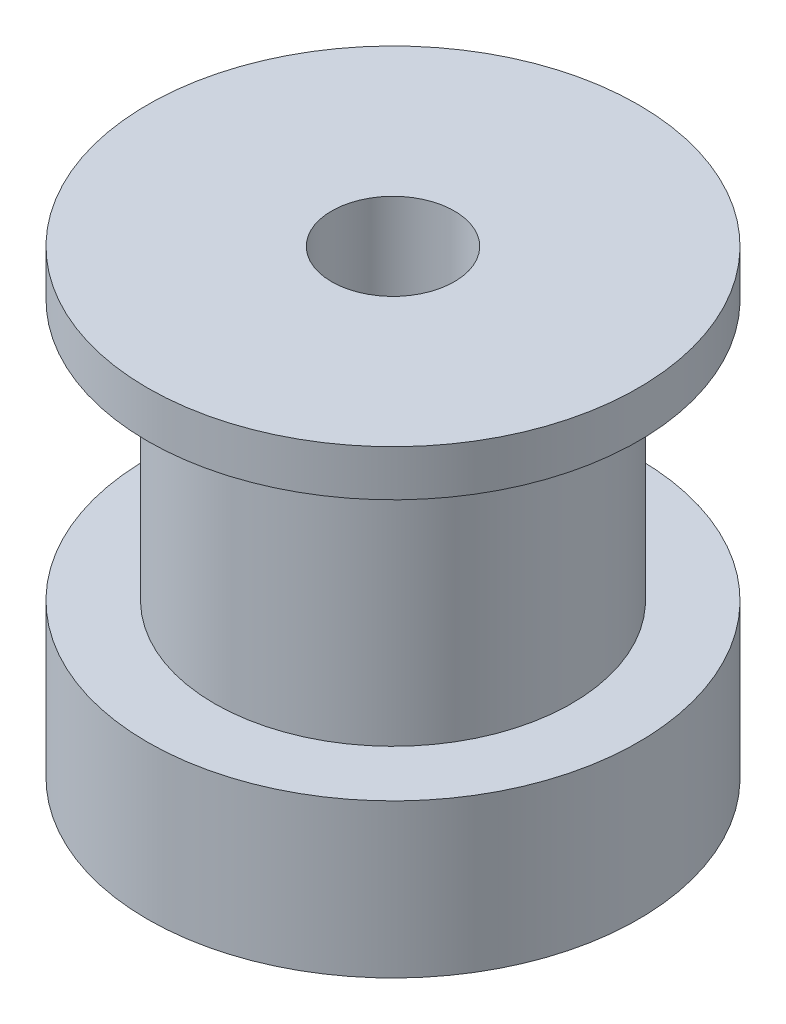
ISO-10303-21;
HEADER;
FILE_DESCRIPTION(('STEP AP214'),'2;1');
FILE_NAME('part.step','',(''),(''),'','','');
FILE_SCHEMA(('AUTOMOTIVE_DESIGN { 1 0 10303 214 1 1 1 1 }'));
ENDSEC;
DATA;
#1=APPLICATION_CONTEXT('core data for automotive mechanical design processes');
#2=APPLICATION_PROTOCOL_DEFINITION('international standard','automotive_design',2000,#1);
#3=PRODUCT_CONTEXT('',#1,'mechanical');
#4=PRODUCT('Part','Part','',(#3));
#5=PRODUCT_RELATED_PRODUCT_CATEGORY('part','',(#4));
#6=PRODUCT_DEFINITION_FORMATION('','',#4);
#7=PRODUCT_DEFINITION_CONTEXT('part definition',#1,'design');
#8=PRODUCT_DEFINITION('design','',#6,#7);
#9=PRODUCT_DEFINITION_SHAPE('','',#8);
#10=(LENGTH_UNIT() NAMED_UNIT(*) SI_UNIT(.MILLI.,.METRE.));
#11=(NAMED_UNIT(*) PLANE_ANGLE_UNIT() SI_UNIT($,.RADIAN.));
#12=(NAMED_UNIT(*) SI_UNIT($,.STERADIAN.) SOLID_ANGLE_UNIT());
#13=UNCERTAINTY_MEASURE_WITH_UNIT(LENGTH_MEASURE(1.E-05),#10,'distance_accuracy_value','');
#14=(GEOMETRIC_REPRESENTATION_CONTEXT(3) GLOBAL_UNCERTAINTY_ASSIGNED_CONTEXT((#13)) GLOBAL_UNIT_ASSIGNED_CONTEXT((#10,
#11,#12)) REPRESENTATION_CONTEXT('',''));
#15=CARTESIAN_POINT('',(0.,0.,0.));
#16=DIRECTION('',(0.,0.,1.));
#17=DIRECTION('',(1.,0.,0.));
#18=AXIS2_PLACEMENT_3D('',#15,#16,#17);
#19=CARTESIAN_POINT('',(0.,5.,0.));
#20=DIRECTION('',(0.,1.,0.));
#21=DIRECTION('',(0.,0.,1.));
#22=AXIS2_PLACEMENT_3D('',#19,#20,#21);
#23=PLANE('',#22);
#24=CARTESIAN_POINT('',(0.,5.,0.));
#25=DIRECTION('',(0.,1.,0.));
#26=DIRECTION('',(0.,0.,1.));
#27=AXIS2_PLACEMENT_3D('',#24,#25,#26);
#28=CIRCLE('',#27,8.);
#29=CARTESIAN_POINT('',(0.,5.,8.));
#30=VERTEX_POINT('',#29);
#31=EDGE_CURVE('E12',#30,#30,#28,.T.);
#32=ORIENTED_EDGE('',*,*,#31,.T.);
#33=EDGE_LOOP('',(#32));
#34=FACE_BOUND('',#33,.T.);
#35=CARTESIAN_POINT('',(0.,5.,0.));
#36=DIRECTION('',(0.,1.,0.));
#37=DIRECTION('',(0.,0.,1.));
#38=AXIS2_PLACEMENT_3D('',#35,#36,#37);
#39=CIRCLE('',#38,5.82);
#40=CARTESIAN_POINT('',(0.,5.,5.82));
#41=VERTEX_POINT('',#40);
#42=EDGE_CURVE('E116',#41,#41,#39,.F.);
#43=ORIENTED_EDGE('',*,*,#42,.T.);
#44=EDGE_LOOP('',(#43));
#45=FACE_BOUND('',#44,.T.);
#46=ADVANCED_FACE('F44',(#34,#45),#23,.T.);
#47=CARTESIAN_POINT('',(0.,0.,0.));
#48=DIRECTION('',(0.,1.,0.));
#49=DIRECTION('',(0.,0.,1.));
#50=AXIS2_PLACEMENT_3D('',#47,#48,#49);
#51=PLANE('',#50);
#52=CARTESIAN_POINT('',(0.,0.,0.));
#53=DIRECTION('',(0.,1.,0.));
#54=DIRECTION('',(0.,0.,1.));
#55=AXIS2_PLACEMENT_3D('',#52,#53,#54);
#56=CIRCLE('',#55,2.);
#57=CARTESIAN_POINT('',(0.,0.,2.));
#58=VERTEX_POINT('',#57);
#59=EDGE_CURVE('E112',#58,#58,#56,.T.);
#60=ORIENTED_EDGE('',*,*,#59,.T.);
#61=EDGE_LOOP('',(#60));
#62=FACE_BOUND('',#61,.T.);
#63=CARTESIAN_POINT('',(0.,0.,0.));
#64=DIRECTION('',(0.,1.,0.));
#65=DIRECTION('',(0.,0.,1.));
#66=AXIS2_PLACEMENT_3D('',#63,#64,#65);
#67=CIRCLE('',#66,8.);
#68=CARTESIAN_POINT('',(0.,0.,8.));
#69=VERTEX_POINT('',#68);
#70=EDGE_CURVE('E48',#69,#69,#67,.T.);
#71=ORIENTED_EDGE('',*,*,#70,.F.);
#72=EDGE_LOOP('',(#71));
#73=FACE_BOUND('',#72,.T.);
#74=ADVANCED_FACE('F101',(#62,#73),#51,.F.);
#75=CARTESIAN_POINT('',(0.,5.,0.));
#76=DIRECTION('',(0.,-1.,0.));
#77=DIRECTION('',(0.,0.,-1.));
#78=AXIS2_PLACEMENT_3D('',#75,#76,#77);
#79=CYLINDRICAL_SURFACE('',#78,8.);
#80=CARTESIAN_POINT('',(-7.74596669241483,2.5,-2.));
#81=CARTESIAN_POINT('',(-7.74596880070288,2.38955939925874,-1.99999686287446));
#82=CARTESIAN_POINT('',(-7.74835444811678,2.27908408105718,-1.99082099639812));
#83=CARTESIAN_POINT('',(-7.75761489594051,2.06130593746119,-1.95441850037103));
#84=CARTESIAN_POINT('',(-7.76449230897304,1.95400499642545,-1.92718136539368));
#85=CARTESIAN_POINT('',(-7.7819097967692,1.74575716945026,-1.85559295970563));
#86=CARTESIAN_POINT('',(-7.79244514152366,1.64480227569144,-1.81126378228359));
#87=CARTESIAN_POINT('',(-7.81598553623007,1.4517513179681,-1.70681691300911));
#88=CARTESIAN_POINT('',(-7.82899069102791,1.35965563033583,-1.64669855084855));
#89=CARTESIAN_POINT('',(-7.856325730845,1.18491068379023,-1.51096674184951));
#90=CARTESIAN_POINT('',(-7.87067678098427,1.10248511971996,-1.43506951016324));
#91=CARTESIAN_POINT('',(-7.89890300412235,0.95139088451173,-1.27054565128053));
#92=CARTESIAN_POINT('',(-7.91277813253111,0.882723499502604,-1.18191783534425));
#93=CARTESIAN_POINT('',(-7.93872332416466,0.760179625894979,-0.992916160863164));
#94=CARTESIAN_POINT('',(-7.95076549920474,0.706522889470829,-0.892395660956096));
#95=CARTESIAN_POINT('',(-7.97144649540787,0.616952284677535,-0.68341054743421));
#96=CARTESIAN_POINT('',(-7.98008581867475,0.58103579846759,-0.574947108633552));
#97=CARTESIAN_POINT('',(-7.99283807078544,0.528681732337134,-0.355487007003329));
#98=CARTESIAN_POINT('',(-7.99703915075451,0.511864284538736,-0.244586175639181));
#99=CARTESIAN_POINT('',(-8.00074875285838,0.496993296579559,-0.0214630554102159));
#100=CARTESIAN_POINT('',(-8.00025796877363,0.498936982232322,0.0907590356304543));
#101=CARTESIAN_POINT('',(-7.99470475962828,0.521259880200117,0.310704494344774));
#102=CARTESIAN_POINT('',(-7.98974401872699,0.541229060043086,0.418472431202134));
#103=CARTESIAN_POINT('',(-7.97592669219883,0.5983770160388,0.629076494827372));
#104=CARTESIAN_POINT('',(-7.96706989918753,0.635556708301928,0.731912358740875));
#105=CARTESIAN_POINT('',(-7.94630007760717,0.726402056549653,0.930813407003612));
#106=CARTESIAN_POINT('',(-7.93436015756043,0.780213635729398,1.02680901953301));
#107=CARTESIAN_POINT('',(-7.90871923047719,0.902684543293007,1.20855124468098));
#108=CARTESIAN_POINT('',(-7.89501791721992,0.971346454848496,1.29429607017101));
#109=CARTESIAN_POINT('',(-7.86690971015616,1.1237669935859,1.45554807016991));
#110=CARTESIAN_POINT('',(-7.85249375620734,1.20788391387822,1.5307153581504));
#111=CARTESIAN_POINT('',(-7.82492034813365,1.3876799788322,1.66595275192604));
#112=CARTESIAN_POINT('',(-7.81176295284776,1.4833596635928,1.72602215209203));
#113=CARTESIAN_POINT('',(-7.78816397465319,1.68423202731917,1.8295762580452));
#114=CARTESIAN_POINT('',(-7.77773586980577,1.78946858425056,1.87297913394098));
#115=CARTESIAN_POINT('',(-7.76094912111966,2.00606837446116,1.94137124127268));
#116=CARTESIAN_POINT('',(-7.75458960648175,2.11743029118651,1.96636441310582));
#117=CARTESIAN_POINT('',(-7.74684284831312,2.3399676012185,1.99666371093214));
#118=CARTESIAN_POINT('',(-7.74532871274918,2.4510702346637,2.0024723791357));
#119=CARTESIAN_POINT('',(-7.74709874784831,2.67265754926253,1.99561359241244));
#120=CARTESIAN_POINT('',(-7.75038247681013,2.78314228636099,1.98294783827904));
#121=CARTESIAN_POINT('',(-7.76125665563648,2.99849141196377,1.93994037115013));
#122=CARTESIAN_POINT('',(-7.768775761875,3.10341818125668,1.9098912546254));
#123=CARTESIAN_POINT('',(-7.7872057461677,3.30674516628135,1.8332944653365));
#124=CARTESIAN_POINT('',(-7.79811702598891,3.40514460724427,1.78674483817004));
#125=CARTESIAN_POINT('',(-7.8223690967461,3.59475302229388,1.67741653434925));
#126=CARTESIAN_POINT('',(-7.83575334885313,3.68578307203448,1.6143374030685));
#127=CARTESIAN_POINT('',(-7.86333666457373,3.85615069024108,1.47412058586891));
#128=CARTESIAN_POINT('',(-7.87753586182776,3.93548633332006,1.39698058961088));
#129=CARTESIAN_POINT('',(-7.90557922425285,4.08224883405677,1.22852544196945));
#130=CARTESIAN_POINT('',(-7.91940561649468,4.14932805003905,1.13690390506319));
#131=CARTESIAN_POINT('',(-7.94477773290987,4.267148693561,0.943405365389351));
#132=CARTESIAN_POINT('',(-7.95632357603169,4.31789097328657,0.841528897915182));
#133=CARTESIAN_POINT('',(-7.9757609259065,4.40115682762235,0.631116403462182));
#134=CARTESIAN_POINT('',(-7.98367864017925,4.43381142750325,0.522634762055765));
#135=CARTESIAN_POINT('',(-7.99508234716634,4.48036826768673,0.301499520637615));
#136=CARTESIAN_POINT('',(-7.99856919514738,4.49427412699123,0.188846730082482));
#137=CARTESIAN_POINT('',(-8.00068338817612,4.50273517915108,-0.0341670528866453));
#138=CARTESIAN_POINT('',(-7.99943957759977,4.49780341819082,-0.144507653932042));
#139=CARTESIAN_POINT('',(-7.99251792914887,4.4699043454113,-0.3627349928295));
#140=CARTESIAN_POINT('',(-7.98684022314338,4.44693756997366,-0.470621803561856));
#141=CARTESIAN_POINT('',(-7.97170865707778,4.38389556045828,-0.680342071289547));
#142=CARTESIAN_POINT('',(-7.96227529004785,4.34391309337124,-0.782204989161725));
#143=CARTESIAN_POINT('',(-7.94062577827316,4.24805884196086,-0.977834106083248));
#144=CARTESIAN_POINT('',(-7.92840928277515,4.19218505465903,-1.07159928253127));
#145=CARTESIAN_POINT('',(-7.90214499360574,4.06456953200774,-1.25080385684661));
#146=CARTESIAN_POINT('',(-7.88806033883329,3.99247971419234,-1.33598997659667));
#147=CARTESIAN_POINT('',(-7.85981298114379,3.83515429604531,-1.49323004054701));
#148=CARTESIAN_POINT('',(-7.84565025934604,3.74991536777768,-1.56528065015318));
#149=CARTESIAN_POINT('',(-7.81854951691005,3.56679717162108,-1.69552405294366));
#150=CARTESIAN_POINT('',(-7.80563927346578,3.46871175326949,-1.75343323883276));
#151=CARTESIAN_POINT('',(-7.78287910989656,3.26388902025036,-1.85185379317094));
#152=CARTESIAN_POINT('',(-7.77302696466427,3.15715806781231,-1.8923778195043));
#153=CARTESIAN_POINT('',(-7.75903817501475,2.95884597632968,-1.94884505714201));
#154=CARTESIAN_POINT('',(-7.75417326006998,2.86821367122773,-1.96798634119376));
#155=CARTESIAN_POINT('',(-7.7476367716524,2.68506226200463,-1.99356458514354));
#156=CARTESIAN_POINT('',(-7.74596492578215,2.5925433195112,-2.0000026287435));
#157=CARTESIAN_POINT('',(-7.74596669241483,2.5,-2.));
#158=B_SPLINE_CURVE_WITH_KNOTS('',3,(#80,#81,#82,#83,#84,#85,#86,#87,#88,#89,#90,#91,#92,#93,
#94,#95,#96,#97,#98,#99,#100,#101,#102,#103,#104,#105,#106,#107,#108,#109,#110,#111,#112,#113,
#114,#115,#116,#117,#118,#119,#120,#121,#122,#123,#124,#125,#126,#127,#128,#129,#130,#131,#132,
#133,#134,#135,#136,#137,#138,#139,#140,#141,#142,#143,#144,#145,#146,#147,#148,#149,#150,#151,
#152,#153,#154,#155,#156,#157),.UNSPECIFIED.,.T.,.F.,(4,2,2,2,2,2,2,2,2,2,2,2,2,2,2,2,2,2,2,2,2,
2,2,2,2,2,2,2,2,2,2,2,2,2,2,2,2,2,4),(0.,0.330981953388909,0.662156593142933,0.992904581732817,
1.32366661404383,1.66099163354381,1.99834817183893,2.34041197118336,2.68242527877674,
3.01751000796277,3.35254518932816,3.68014610151158,4.00776445379829,4.33834299403556,
4.66897908375131,5.00856373257529,5.34816424959841,5.68941145606722,6.03058560103638,
6.36274859809374,6.69488101747041,7.02157924007365,7.34831617137134,7.68146276687326,
8.01466415108036,8.35620264772255,8.69772332575643,9.03673658245543,9.3756843912723,
9.70546756901965,10.0352409390158,10.3632390124777,10.6912784459046,11.0271767726566,
11.3631602525241,11.7054118182895,12.0474137709606,12.3247826174462,12.6021278008238),.UNSPECIFIED.);
#159=CARTESIAN_POINT('',(-7.74596669241483,2.5,-2.));
#160=VERTEX_POINT('',#159);
#161=EDGE_CURVE('E67',#160,#160,#158,.T.);
#162=ORIENTED_EDGE('',*,*,#161,.F.);
#163=EDGE_LOOP('',(#162));
#164=FACE_BOUND('',#163,.T.);
#165=ORIENTED_EDGE('',*,*,#31,.F.);
#166=EDGE_LOOP('',(#165));
#167=FACE_BOUND('',#166,.T.);
#168=ORIENTED_EDGE('',*,*,#70,.T.);
#169=EDGE_LOOP('',(#168));
#170=FACE_BOUND('',#169,.T.);
#171=ADVANCED_FACE('F46',(#164,#167,#170),#79,.T.);
#172=CARTESIAN_POINT('',(0.,5.,0.));
#173=DIRECTION('',(0.,-1.,0.));
#174=DIRECTION('',(0.,0.,-1.));
#175=AXIS2_PLACEMENT_3D('',#172,#173,#174);
#176=CYLINDRICAL_SURFACE('',#175,2.);
#177=CARTESIAN_POINT('',(0.,2.5,0.));
#178=DIRECTION('',(0.707106781186547,-0.707106781186547,0.));
#179=DIRECTION('',(0.707106781186547,0.707106781186547,0.));
#180=AXIS2_PLACEMENT_3D('',#177,#178,#179);
#181=ELLIPSE('',#180,2.82842712474619,2.);
#182=CARTESIAN_POINT('',(0.,2.5,-2.));
#183=VERTEX_POINT('',#182);
#184=CARTESIAN_POINT('',(0.,2.5,2.));
#185=VERTEX_POINT('',#184);
#186=EDGE_CURVE('E58',#183,#185,#181,.F.);
#187=ORIENTED_EDGE('',*,*,#186,.T.);
#188=CARTESIAN_POINT('',(0.,2.5,0.));
#189=DIRECTION('',(0.707106781186547,0.707106781186547,0.));
#190=DIRECTION('',(0.707106781186547,-0.707106781186547,0.));
#191=AXIS2_PLACEMENT_3D('',#188,#189,#190);
#192=ELLIPSE('',#191,2.82842712474619,2.);
#193=EDGE_CURVE('E60',#185,#183,#192,.F.);
#194=ORIENTED_EDGE('',*,*,#193,.T.);
#195=EDGE_LOOP('',(#187,#194));
#196=FACE_BOUND('',#195,.T.);
#197=ORIENTED_EDGE('',*,*,#59,.F.);
#198=EDGE_LOOP('',(#197));
#199=FACE_BOUND('',#198,.T.);
#200=CARTESIAN_POINT('',(0.,15.,0.));
#201=DIRECTION('',(0.,1.,0.));
#202=DIRECTION('',(0.,0.,1.));
#203=AXIS2_PLACEMENT_3D('',#200,#201,#202);
#204=CIRCLE('',#203,2.);
#205=CARTESIAN_POINT('',(0.,15.,2.));
#206=VERTEX_POINT('',#205);
#207=EDGE_CURVE('E70',#206,#206,#204,.T.);
#208=ORIENTED_EDGE('',*,*,#207,.T.);
#209=EDGE_LOOP('',(#208));
#210=FACE_BOUND('',#209,.T.);
#211=ADVANCED_FACE('F65',(#196,#199,#210),#176,.F.);
#212=CARTESIAN_POINT('',(0.,13.5,0.));
#213=DIRECTION('',(0.,-1.,0.));
#214=DIRECTION('',(0.,0.,-1.));
#215=AXIS2_PLACEMENT_3D('',#212,#213,#214);
#216=CYLINDRICAL_SURFACE('',#215,5.82);
#217=ORIENTED_EDGE('',*,*,#42,.F.);
#218=EDGE_LOOP('',(#217));
#219=FACE_BOUND('',#218,.T.);
#220=CARTESIAN_POINT('',(0.,13.5,0.));
#221=DIRECTION('',(0.,1.,0.));
#222=DIRECTION('',(0.,0.,1.));
#223=AXIS2_PLACEMENT_3D('',#220,#221,#222);
#224=CIRCLE('',#223,5.82);
#225=CARTESIAN_POINT('',(0.,13.5,5.82));
#226=VERTEX_POINT('',#225);
#227=EDGE_CURVE('E119',#226,#226,#224,.T.);
#228=ORIENTED_EDGE('',*,*,#227,.F.);
#229=EDGE_LOOP('',(#228));
#230=FACE_BOUND('',#229,.T.);
#231=ADVANCED_FACE('F87',(#219,#230),#216,.T.);
#232=CARTESIAN_POINT('',(0.,15.,0.));
#233=DIRECTION('',(0.,1.,0.));
#234=DIRECTION('',(0.,0.,1.));
#235=AXIS2_PLACEMENT_3D('',#232,#233,#234);
#236=PLANE('',#235);
#237=CARTESIAN_POINT('',(0.,15.,0.));
#238=DIRECTION('',(0.,1.,0.));
#239=DIRECTION('',(0.,0.,1.));
#240=AXIS2_PLACEMENT_3D('',#237,#238,#239);
#241=CIRCLE('',#240,8.);
#242=CARTESIAN_POINT('',(0.,15.,8.));
#243=VERTEX_POINT('',#242);
#244=EDGE_CURVE('E124',#243,#243,#241,.T.);
#245=ORIENTED_EDGE('',*,*,#244,.T.);
#246=EDGE_LOOP('',(#245));
#247=FACE_BOUND('',#246,.T.);
#248=ORIENTED_EDGE('',*,*,#207,.F.);
#249=EDGE_LOOP('',(#248));
#250=FACE_BOUND('',#249,.T.);
#251=ADVANCED_FACE('F83',(#247,#250),#236,.T.);
#252=CARTESIAN_POINT('',(0.,13.5,0.));
#253=DIRECTION('',(0.,1.,0.));
#254=DIRECTION('',(0.,0.,1.));
#255=AXIS2_PLACEMENT_3D('',#252,#253,#254);
#256=PLANE('',#255);
#257=ORIENTED_EDGE('',*,*,#227,.T.);
#258=EDGE_LOOP('',(#257));
#259=FACE_BOUND('',#258,.T.);
#260=CARTESIAN_POINT('',(0.,13.5,0.));
#261=DIRECTION('',(0.,1.,0.));
#262=DIRECTION('',(0.,0.,1.));
#263=AXIS2_PLACEMENT_3D('',#260,#261,#262);
#264=CIRCLE('',#263,8.);
#265=CARTESIAN_POINT('',(0.,13.5,8.));
#266=VERTEX_POINT('',#265);
#267=EDGE_CURVE('E125',#266,#266,#264,.T.);
#268=ORIENTED_EDGE('',*,*,#267,.F.);
#269=EDGE_LOOP('',(#268));
#270=FACE_BOUND('',#269,.T.);
#271=ADVANCED_FACE('F86',(#259,#270),#256,.F.);
#272=CARTESIAN_POINT('',(0.,15.,0.));
#273=DIRECTION('',(0.,-1.,0.));
#274=DIRECTION('',(0.,0.,-1.));
#275=AXIS2_PLACEMENT_3D('',#272,#273,#274);
#276=CYLINDRICAL_SURFACE('',#275,8.);
#277=ORIENTED_EDGE('',*,*,#244,.F.);
#278=EDGE_LOOP('',(#277));
#279=FACE_BOUND('',#278,.T.);
#280=ORIENTED_EDGE('',*,*,#267,.T.);
#281=EDGE_LOOP('',(#280));
#282=FACE_BOUND('',#281,.T.);
#283=ADVANCED_FACE('F82',(#279,#282),#276,.T.);
#284=CARTESIAN_POINT('',(-8.001,2.5,0.));
#285=DIRECTION('',(1.,0.,0.));
#286=DIRECTION('',(0.,0.,-1.));
#287=AXIS2_PLACEMENT_3D('',#284,#285,#286);
#288=CYLINDRICAL_SURFACE('',#287,2.);
#289=ORIENTED_EDGE('',*,*,#193,.F.);
#290=ORIENTED_EDGE('',*,*,#186,.F.);
#291=EDGE_LOOP('',(#289,#290));
#292=FACE_BOUND('',#291,.T.);
#293=ORIENTED_EDGE('',*,*,#161,.T.);
#294=EDGE_LOOP('',(#293));
#295=FACE_BOUND('',#294,.T.);
#296=ADVANCED_FACE('F61',(#292,#295),#288,.F.);
#297=CLOSED_SHELL('',(#46,#74,#171,#211,#231,#251,#271,#283,#296));
#298=MANIFOLD_SOLID_BREP('B2',#297);
#299=ADVANCED_BREP_SHAPE_REPRESENTATION('',(#18,#298),#14);
#300=SHAPE_DEFINITION_REPRESENTATION(#9,#299);
ENDSEC;
END-ISO-10303-21;
